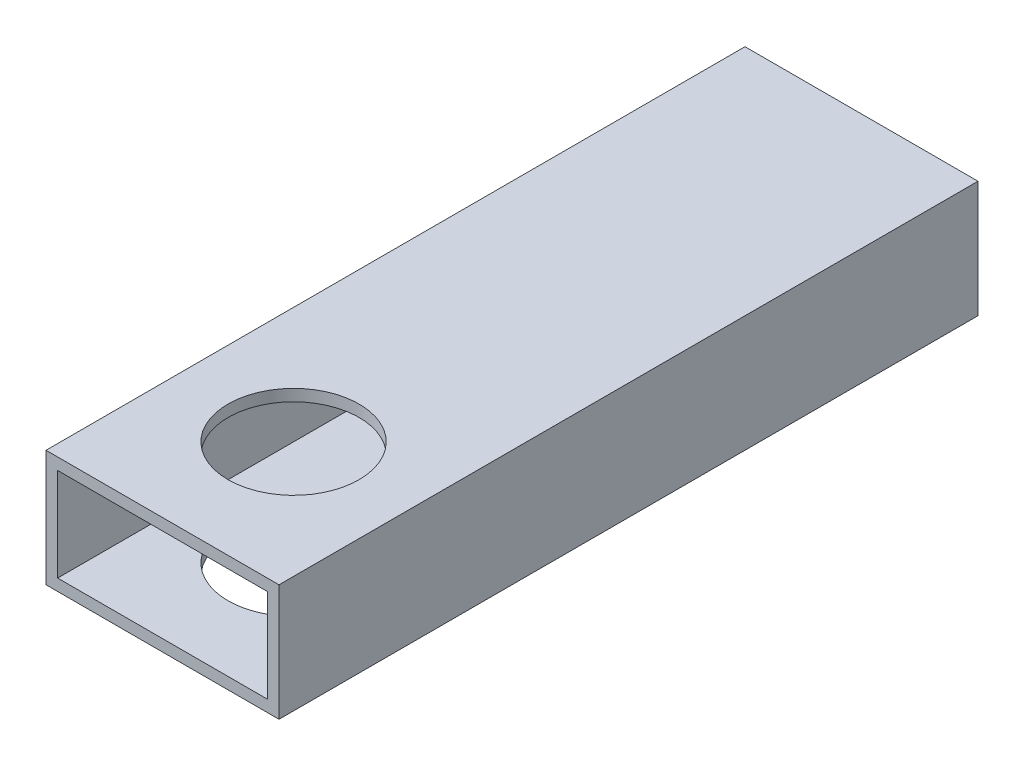
ISO-10303-21;
HEADER;
FILE_DESCRIPTION(('STEP AP214'),'2;1');
FILE_NAME('part.step','',(''),(''),'','','');
FILE_SCHEMA(('AUTOMOTIVE_DESIGN { 1 0 10303 214 1 1 1 1 }'));
ENDSEC;
DATA;
#1=APPLICATION_CONTEXT('core data for automotive mechanical design processes');
#2=APPLICATION_PROTOCOL_DEFINITION('international standard','automotive_design',2000,#1);
#3=PRODUCT_CONTEXT('',#1,'mechanical');
#4=PRODUCT('Part','Part','',(#3));
#5=PRODUCT_RELATED_PRODUCT_CATEGORY('part','',(#4));
#6=PRODUCT_DEFINITION_FORMATION('','',#4);
#7=PRODUCT_DEFINITION_CONTEXT('part definition',#1,'design');
#8=PRODUCT_DEFINITION('design','',#6,#7);
#9=PRODUCT_DEFINITION_SHAPE('','',#8);
#10=(LENGTH_UNIT() NAMED_UNIT(*) SI_UNIT(.MILLI.,.METRE.));
#11=(NAMED_UNIT(*) PLANE_ANGLE_UNIT() SI_UNIT($,.RADIAN.));
#12=(NAMED_UNIT(*) SI_UNIT($,.STERADIAN.) SOLID_ANGLE_UNIT());
#13=UNCERTAINTY_MEASURE_WITH_UNIT(LENGTH_MEASURE(1.E-05),#10,'distance_accuracy_value','');
#14=(GEOMETRIC_REPRESENTATION_CONTEXT(3) GLOBAL_UNCERTAINTY_ASSIGNED_CONTEXT((#13)) GLOBAL_UNIT_ASSIGNED_CONTEXT((#10,
#11,#12)) REPRESENTATION_CONTEXT('',''));
#15=CARTESIAN_POINT('',(0.,0.,0.));
#16=DIRECTION('',(0.,0.,1.));
#17=DIRECTION('',(1.,0.,0.));
#18=AXIS2_PLACEMENT_3D('',#15,#16,#17);
#19=CARTESIAN_POINT('',(0.,0.,152.4));
#20=DIRECTION('',(0.,0.,1.));
#21=DIRECTION('',(1.,0.,0.));
#22=AXIS2_PLACEMENT_3D('',#19,#20,#21);
#23=PLANE('',#22);
#24=DIRECTION('',(0.,-1.,0.));
#25=VECTOR('',#24,1.);
#26=CARTESIAN_POINT('',(0.,0.,152.4));
#27=LINE('',#26,#25);
#28=CARTESIAN_POINT('',(0.,0.,152.4));
#29=VERTEX_POINT('',#28);
#30=CARTESIAN_POINT('',(0.,-25.4,152.4));
#31=VERTEX_POINT('',#30);
#32=EDGE_CURVE('E137',#29,#31,#27,.T.);
#33=ORIENTED_EDGE('',*,*,#32,.T.);
#34=DIRECTION('',(1.,0.,0.));
#35=VECTOR('',#34,1.);
#36=CARTESIAN_POINT('',(0.,-25.4,152.4));
#37=LINE('',#36,#35);
#38=CARTESIAN_POINT('',(50.8,-25.4,152.4));
#39=VERTEX_POINT('',#38);
#40=EDGE_CURVE('E140',#31,#39,#37,.T.);
#41=ORIENTED_EDGE('',*,*,#40,.T.);
#42=DIRECTION('',(0.,1.,0.));
#43=VECTOR('',#42,1.);
#44=CARTESIAN_POINT('',(50.8,0.,152.4));
#45=LINE('',#44,#43);
#46=CARTESIAN_POINT('',(50.8,0.,152.4));
#47=VERTEX_POINT('',#46);
#48=EDGE_CURVE('E143',#39,#47,#45,.T.);
#49=ORIENTED_EDGE('',*,*,#48,.T.);
#50=DIRECTION('',(-1.,0.,0.));
#51=VECTOR('',#50,1.);
#52=CARTESIAN_POINT('',(0.,0.,152.4));
#53=LINE('',#52,#51);
#54=EDGE_CURVE('E145',#47,#29,#53,.T.);
#55=ORIENTED_EDGE('',*,*,#54,.T.);
#56=EDGE_LOOP('',(#33,#41,#49,#55));
#57=FACE_BOUND('',#56,.T.);
#58=DIRECTION('',(1.,0.,0.));
#59=VECTOR('',#58,1.);
#60=CARTESIAN_POINT('',(2.54,-22.86,152.4));
#61=LINE('',#60,#59);
#62=CARTESIAN_POINT('',(2.54,-22.86,152.4));
#63=VERTEX_POINT('',#62);
#64=CARTESIAN_POINT('',(48.26,-22.86,152.4));
#65=VERTEX_POINT('',#64);
#66=EDGE_CURVE('E107',#63,#65,#61,.T.);
#67=ORIENTED_EDGE('',*,*,#66,.F.);
#68=DIRECTION('',(0.,-1.,0.));
#69=VECTOR('',#68,1.);
#70=CARTESIAN_POINT('',(2.54,-2.54,152.4));
#71=LINE('',#70,#69);
#72=CARTESIAN_POINT('',(2.54,-2.54,152.4));
#73=VERTEX_POINT('',#72);
#74=EDGE_CURVE('E99',#73,#63,#71,.T.);
#75=ORIENTED_EDGE('',*,*,#74,.F.);
#76=DIRECTION('',(-1.,0.,0.));
#77=VECTOR('',#76,1.);
#78=CARTESIAN_POINT('',(2.54,-2.54,152.4));
#79=LINE('',#78,#77);
#80=CARTESIAN_POINT('',(48.26,-2.53999999999999,152.4));
#81=VERTEX_POINT('',#80);
#82=EDGE_CURVE('E121',#81,#73,#79,.T.);
#83=ORIENTED_EDGE('',*,*,#82,.F.);
#84=DIRECTION('',(0.,1.,0.));
#85=VECTOR('',#84,1.);
#86=CARTESIAN_POINT('',(48.26,-2.53999999999999,152.4));
#87=LINE('',#86,#85);
#88=EDGE_CURVE('E119',#65,#81,#87,.T.);
#89=ORIENTED_EDGE('',*,*,#88,.F.);
#90=EDGE_LOOP('',(#67,#75,#83,#89));
#91=FACE_BOUND('',#90,.T.);
#92=ADVANCED_FACE('F33',(#57,#91),#23,.T.);
#93=CARTESIAN_POINT('',(0.,0.,0.));
#94=DIRECTION('',(0.,0.,1.));
#95=DIRECTION('',(1.,0.,0.));
#96=AXIS2_PLACEMENT_3D('',#93,#94,#95);
#97=PLANE('',#96);
#98=DIRECTION('',(0.,-1.,0.));
#99=VECTOR('',#98,1.);
#100=CARTESIAN_POINT('',(0.,0.,0.));
#101=LINE('',#100,#99);
#102=CARTESIAN_POINT('',(0.,0.,0.));
#103=VERTEX_POINT('',#102);
#104=CARTESIAN_POINT('',(0.,-25.4,0.));
#105=VERTEX_POINT('',#104);
#106=EDGE_CURVE('E115',#103,#105,#101,.T.);
#107=ORIENTED_EDGE('',*,*,#106,.F.);
#108=DIRECTION('',(-1.,0.,0.));
#109=VECTOR('',#108,1.);
#110=CARTESIAN_POINT('',(0.,0.,0.));
#111=LINE('',#110,#109);
#112=CARTESIAN_POINT('',(50.8,0.,0.));
#113=VERTEX_POINT('',#112);
#114=EDGE_CURVE('E141',#113,#103,#111,.T.);
#115=ORIENTED_EDGE('',*,*,#114,.F.);
#116=DIRECTION('',(0.,1.,0.));
#117=VECTOR('',#116,1.);
#118=CARTESIAN_POINT('',(50.8,0.,0.));
#119=LINE('',#118,#117);
#120=CARTESIAN_POINT('',(50.8,-25.4,0.));
#121=VERTEX_POINT('',#120);
#122=EDGE_CURVE('E152',#121,#113,#119,.T.);
#123=ORIENTED_EDGE('',*,*,#122,.F.);
#124=DIRECTION('',(1.,0.,0.));
#125=VECTOR('',#124,1.);
#126=CARTESIAN_POINT('',(0.,-25.4,0.));
#127=LINE('',#126,#125);
#128=EDGE_CURVE('E150',#105,#121,#127,.T.);
#129=ORIENTED_EDGE('',*,*,#128,.F.);
#130=EDGE_LOOP('',(#107,#115,#123,#129));
#131=FACE_BOUND('',#130,.T.);
#132=DIRECTION('',(0.,-1.,0.));
#133=VECTOR('',#132,1.);
#134=CARTESIAN_POINT('',(2.54,-2.54,0.));
#135=LINE('',#134,#133);
#136=CARTESIAN_POINT('',(2.54,-2.54,0.));
#137=VERTEX_POINT('',#136);
#138=CARTESIAN_POINT('',(2.54,-22.86,0.));
#139=VERTEX_POINT('',#138);
#140=EDGE_CURVE('E57',#137,#139,#135,.T.);
#141=ORIENTED_EDGE('',*,*,#140,.T.);
#142=DIRECTION('',(1.,0.,0.));
#143=VECTOR('',#142,1.);
#144=CARTESIAN_POINT('',(2.54,-22.86,0.));
#145=LINE('',#144,#143);
#146=CARTESIAN_POINT('',(48.26,-22.86,0.));
#147=VERTEX_POINT('',#146);
#148=EDGE_CURVE('E114',#139,#147,#145,.T.);
#149=ORIENTED_EDGE('',*,*,#148,.T.);
#150=DIRECTION('',(0.,1.,0.));
#151=VECTOR('',#150,1.);
#152=CARTESIAN_POINT('',(48.26,-2.53999999999999,0.));
#153=LINE('',#152,#151);
#154=CARTESIAN_POINT('',(48.26,-2.53999999999999,0.));
#155=VERTEX_POINT('',#154);
#156=EDGE_CURVE('E129',#147,#155,#153,.T.);
#157=ORIENTED_EDGE('',*,*,#156,.T.);
#158=DIRECTION('',(-1.,0.,0.));
#159=VECTOR('',#158,1.);
#160=CARTESIAN_POINT('',(2.54,-2.54,0.));
#161=LINE('',#160,#159);
#162=EDGE_CURVE('E108',#155,#137,#161,.T.);
#163=ORIENTED_EDGE('',*,*,#162,.T.);
#164=EDGE_LOOP('',(#141,#149,#157,#163));
#165=FACE_BOUND('',#164,.T.);
#166=ADVANCED_FACE('F171',(#131,#165),#97,.F.);
#167=CARTESIAN_POINT('',(0.,0.,152.4));
#168=DIRECTION('',(1.,0.,0.));
#169=DIRECTION('',(0.,1.,0.));
#170=AXIS2_PLACEMENT_3D('',#167,#168,#169);
#171=PLANE('',#170);
#172=ORIENTED_EDGE('',*,*,#106,.T.);
#173=DIRECTION('',(0.,0.,-1.));
#174=VECTOR('',#173,1.);
#175=CARTESIAN_POINT('',(0.,-25.4,152.4));
#176=LINE('',#175,#174);
#177=EDGE_CURVE('E11',#31,#105,#176,.T.);
#178=ORIENTED_EDGE('',*,*,#177,.F.);
#179=ORIENTED_EDGE('',*,*,#32,.F.);
#180=DIRECTION('',(0.,0.,-1.));
#181=VECTOR('',#180,1.);
#182=CARTESIAN_POINT('',(0.,0.,152.4));
#183=LINE('',#182,#181);
#184=EDGE_CURVE('E147',#29,#103,#183,.T.);
#185=ORIENTED_EDGE('',*,*,#184,.T.);
#186=EDGE_LOOP('',(#172,#178,#179,#185));
#187=FACE_BOUND('',#186,.T.);
#188=ADVANCED_FACE('F35',(#187),#171,.F.);
#189=CARTESIAN_POINT('',(0.,-25.4,152.4));
#190=DIRECTION('',(0.,1.,0.));
#191=DIRECTION('',(0.,0.,1.));
#192=AXIS2_PLACEMENT_3D('',#189,#190,#191);
#193=PLANE('',#192);
#194=CARTESIAN_POINT('',(25.4,-25.4,123.825));
#195=DIRECTION('',(0.,1.,0.));
#196=DIRECTION('',(0.,0.,1.));
#197=AXIS2_PLACEMENT_3D('',#194,#195,#196);
#198=CIRCLE('',#197,14.2875);
#199=CARTESIAN_POINT('',(25.4,-25.4,138.1125));
#200=VERTEX_POINT('',#199);
#201=EDGE_CURVE('E127',#200,#200,#198,.T.);
#202=ORIENTED_EDGE('',*,*,#201,.T.);
#203=EDGE_LOOP('',(#202));
#204=FACE_BOUND('',#203,.T.);
#205=ORIENTED_EDGE('',*,*,#128,.T.);
#206=DIRECTION('',(0.,0.,-1.));
#207=VECTOR('',#206,1.);
#208=CARTESIAN_POINT('',(50.8,-25.4,152.4));
#209=LINE('',#208,#207);
#210=EDGE_CURVE('E42',#39,#121,#209,.T.);
#211=ORIENTED_EDGE('',*,*,#210,.F.);
#212=ORIENTED_EDGE('',*,*,#40,.F.);
#213=ORIENTED_EDGE('',*,*,#177,.T.);
#214=EDGE_LOOP('',(#205,#211,#212,#213));
#215=FACE_BOUND('',#214,.T.);
#216=ADVANCED_FACE('F181',(#204,#215),#193,.F.);
#217=CARTESIAN_POINT('',(50.8,0.,152.4));
#218=DIRECTION('',(-1.,0.,0.));
#219=DIRECTION('',(0.,0.,1.));
#220=AXIS2_PLACEMENT_3D('',#217,#218,#219);
#221=PLANE('',#220);
#222=ORIENTED_EDGE('',*,*,#122,.T.);
#223=DIRECTION('',(0.,0.,-1.));
#224=VECTOR('',#223,1.);
#225=CARTESIAN_POINT('',(50.8,0.,152.4));
#226=LINE('',#225,#224);
#227=EDGE_CURVE('E157',#47,#113,#226,.T.);
#228=ORIENTED_EDGE('',*,*,#227,.F.);
#229=ORIENTED_EDGE('',*,*,#48,.F.);
#230=ORIENTED_EDGE('',*,*,#210,.T.);
#231=EDGE_LOOP('',(#222,#228,#229,#230));
#232=FACE_BOUND('',#231,.T.);
#233=ADVANCED_FACE('F165',(#232),#221,.F.);
#234=CARTESIAN_POINT('',(0.,0.,152.4));
#235=DIRECTION('',(0.,-1.,0.));
#236=DIRECTION('',(0.,0.,-1.));
#237=AXIS2_PLACEMENT_3D('',#234,#235,#236);
#238=PLANE('',#237);
#239=CARTESIAN_POINT('',(25.4,0.,123.825));
#240=DIRECTION('',(0.,1.,0.));
#241=DIRECTION('',(0.,0.,1.));
#242=AXIS2_PLACEMENT_3D('',#239,#240,#241);
#243=CIRCLE('',#242,14.2875);
#244=CARTESIAN_POINT('',(25.4,0.,138.1125));
#245=VERTEX_POINT('',#244);
#246=EDGE_CURVE('E208',#245,#245,#243,.T.);
#247=ORIENTED_EDGE('',*,*,#246,.F.);
#248=EDGE_LOOP('',(#247));
#249=FACE_BOUND('',#248,.T.);
#250=ORIENTED_EDGE('',*,*,#114,.T.);
#251=ORIENTED_EDGE('',*,*,#184,.F.);
#252=ORIENTED_EDGE('',*,*,#54,.F.);
#253=ORIENTED_EDGE('',*,*,#227,.T.);
#254=EDGE_LOOP('',(#250,#251,#252,#253));
#255=FACE_BOUND('',#254,.T.);
#256=ADVANCED_FACE('F175',(#249,#255),#238,.F.);
#257=CARTESIAN_POINT('',(2.54,-2.54,152.4));
#258=DIRECTION('',(1.,0.,0.));
#259=DIRECTION('',(0.,0.,-1.));
#260=AXIS2_PLACEMENT_3D('',#257,#258,#259);
#261=PLANE('',#260);
#262=ORIENTED_EDGE('',*,*,#140,.F.);
#263=DIRECTION('',(0.,0.,-1.));
#264=VECTOR('',#263,1.);
#265=CARTESIAN_POINT('',(2.54,-2.54,152.4));
#266=LINE('',#265,#264);
#267=EDGE_CURVE('E103',#73,#137,#266,.T.);
#268=ORIENTED_EDGE('',*,*,#267,.F.);
#269=ORIENTED_EDGE('',*,*,#74,.T.);
#270=DIRECTION('',(0.,0.,-1.));
#271=VECTOR('',#270,1.);
#272=CARTESIAN_POINT('',(2.54,-22.86,152.4));
#273=LINE('',#272,#271);
#274=EDGE_CURVE('E102',#63,#139,#273,.T.);
#275=ORIENTED_EDGE('',*,*,#274,.T.);
#276=EDGE_LOOP('',(#262,#268,#269,#275));
#277=FACE_BOUND('',#276,.T.);
#278=ADVANCED_FACE('F101',(#277),#261,.T.);
#279=CARTESIAN_POINT('',(2.54,-22.86,152.4));
#280=DIRECTION('',(0.,1.,0.));
#281=DIRECTION('',(-1.,0.,0.));
#282=AXIS2_PLACEMENT_3D('',#279,#280,#281);
#283=PLANE('',#282);
#284=CARTESIAN_POINT('',(25.4,-22.86,123.825));
#285=DIRECTION('',(0.,1.,0.));
#286=DIRECTION('',(-1.,0.,0.));
#287=AXIS2_PLACEMENT_3D('',#284,#285,#286);
#288=CIRCLE('',#287,14.2875);
#289=CARTESIAN_POINT('',(11.1125,-22.86,123.825));
#290=VERTEX_POINT('',#289);
#291=EDGE_CURVE('E212',#290,#290,#288,.T.);
#292=ORIENTED_EDGE('',*,*,#291,.F.);
#293=EDGE_LOOP('',(#292));
#294=FACE_BOUND('',#293,.T.);
#295=ORIENTED_EDGE('',*,*,#148,.F.);
#296=ORIENTED_EDGE('',*,*,#274,.F.);
#297=ORIENTED_EDGE('',*,*,#66,.T.);
#298=DIRECTION('',(0.,0.,-1.));
#299=VECTOR('',#298,1.);
#300=CARTESIAN_POINT('',(48.26,-22.86,152.4));
#301=LINE('',#300,#299);
#302=EDGE_CURVE('E116',#65,#147,#301,.T.);
#303=ORIENTED_EDGE('',*,*,#302,.T.);
#304=EDGE_LOOP('',(#295,#296,#297,#303));
#305=FACE_BOUND('',#304,.T.);
#306=ADVANCED_FACE('F111',(#294,#305),#283,.T.);
#307=CARTESIAN_POINT('',(48.26,-2.53999999999999,152.4));
#308=DIRECTION('',(-1.,0.,0.));
#309=DIRECTION('',(0.,0.,1.));
#310=AXIS2_PLACEMENT_3D('',#307,#308,#309);
#311=PLANE('',#310);
#312=ORIENTED_EDGE('',*,*,#156,.F.);
#313=ORIENTED_EDGE('',*,*,#302,.F.);
#314=ORIENTED_EDGE('',*,*,#88,.T.);
#315=DIRECTION('',(0.,0.,-1.));
#316=VECTOR('',#315,1.);
#317=CARTESIAN_POINT('',(48.26,-2.53999999999999,152.4));
#318=LINE('',#317,#316);
#319=EDGE_CURVE('E49',#81,#155,#318,.T.);
#320=ORIENTED_EDGE('',*,*,#319,.T.);
#321=EDGE_LOOP('',(#312,#313,#314,#320));
#322=FACE_BOUND('',#321,.T.);
#323=ADVANCED_FACE('F230',(#322),#311,.T.);
#324=CARTESIAN_POINT('',(2.54,-2.54,152.4));
#325=DIRECTION('',(0.,-1.,0.));
#326=DIRECTION('',(1.,0.,0.));
#327=AXIS2_PLACEMENT_3D('',#324,#325,#326);
#328=PLANE('',#327);
#329=CARTESIAN_POINT('',(25.4,-2.54000000000001,123.825));
#330=DIRECTION('',(0.,-1.,0.));
#331=DIRECTION('',(1.,0.,0.));
#332=AXIS2_PLACEMENT_3D('',#329,#330,#331);
#333=CIRCLE('',#332,14.2875);
#334=CARTESIAN_POINT('',(39.6875,-2.54000000000001,123.825));
#335=VERTEX_POINT('',#334);
#336=EDGE_CURVE('E37',#335,#335,#333,.T.);
#337=ORIENTED_EDGE('',*,*,#336,.F.);
#338=EDGE_LOOP('',(#337));
#339=FACE_BOUND('',#338,.T.);
#340=ORIENTED_EDGE('',*,*,#162,.F.);
#341=ORIENTED_EDGE('',*,*,#319,.F.);
#342=ORIENTED_EDGE('',*,*,#82,.T.);
#343=ORIENTED_EDGE('',*,*,#267,.T.);
#344=EDGE_LOOP('',(#340,#341,#342,#343));
#345=FACE_BOUND('',#344,.T.);
#346=ADVANCED_FACE('F225',(#339,#345),#328,.T.);
#347=CARTESIAN_POINT('',(25.4,-152.4,123.825));
#348=DIRECTION('',(0.,1.,0.));
#349=DIRECTION('',(0.,0.,1.));
#350=AXIS2_PLACEMENT_3D('',#347,#348,#349);
#351=CYLINDRICAL_SURFACE('',#350,14.2875);
#352=ORIENTED_EDGE('',*,*,#336,.T.);
#353=EDGE_LOOP('',(#352));
#354=FACE_BOUND('',#353,.T.);
#355=ORIENTED_EDGE('',*,*,#246,.T.);
#356=EDGE_LOOP('',(#355));
#357=FACE_BOUND('',#356,.T.);
#358=ADVANCED_FACE('F219',(#354,#357),#351,.F.);
#359=ORIENTED_EDGE('',*,*,#291,.T.);
#360=EDGE_LOOP('',(#359));
#361=FACE_BOUND('',#360,.T.);
#362=ORIENTED_EDGE('',*,*,#201,.F.);
#363=EDGE_LOOP('',(#362));
#364=FACE_BOUND('',#363,.T.);
#365=ADVANCED_FACE('F217',(#361,#364),#351,.F.);
#366=CLOSED_SHELL('',(#92,#166,#188,#216,#233,#256,#278,#306,#323,#346,#358,#365));
#367=MANIFOLD_SOLID_BREP('B2',#366);
#368=ADVANCED_BREP_SHAPE_REPRESENTATION('',(#18,#367),#14);
#369=SHAPE_DEFINITION_REPRESENTATION(#9,#368);
ENDSEC;
END-ISO-10303-21;
